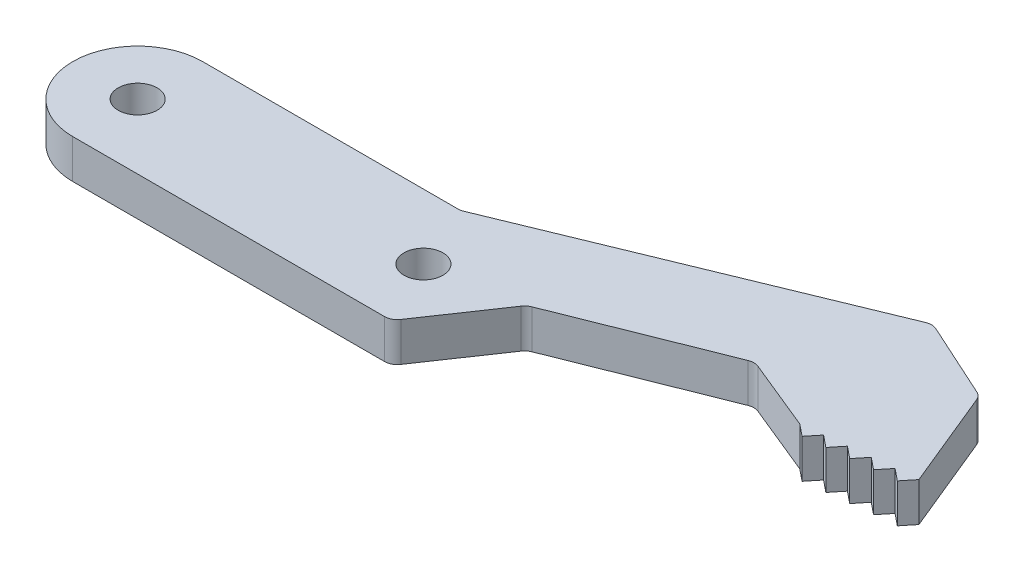
ISO-10303-21;
HEADER;
FILE_DESCRIPTION(('STEP AP214'),'2;1');
FILE_NAME('part.step','',(''),(''),'','','');
FILE_SCHEMA(('AUTOMOTIVE_DESIGN { 1 0 10303 214 1 1 1 1 }'));
ENDSEC;
DATA;
#1=APPLICATION_CONTEXT('core data for automotive mechanical design processes');
#2=APPLICATION_PROTOCOL_DEFINITION('international standard','automotive_design',2000,#1);
#3=PRODUCT_CONTEXT('',#1,'mechanical');
#4=PRODUCT('Part','Part','',(#3));
#5=PRODUCT_RELATED_PRODUCT_CATEGORY('part','',(#4));
#6=PRODUCT_DEFINITION_FORMATION('','',#4);
#7=PRODUCT_DEFINITION_CONTEXT('part definition',#1,'design');
#8=PRODUCT_DEFINITION('design','',#6,#7);
#9=PRODUCT_DEFINITION_SHAPE('','',#8);
#10=(LENGTH_UNIT() NAMED_UNIT(*) SI_UNIT(.MILLI.,.METRE.));
#11=(NAMED_UNIT(*) PLANE_ANGLE_UNIT() SI_UNIT($,.RADIAN.));
#12=(NAMED_UNIT(*) SI_UNIT($,.STERADIAN.) SOLID_ANGLE_UNIT());
#13=UNCERTAINTY_MEASURE_WITH_UNIT(LENGTH_MEASURE(1.E-05),#10,'distance_accuracy_value','');
#14=(GEOMETRIC_REPRESENTATION_CONTEXT(3) GLOBAL_UNCERTAINTY_ASSIGNED_CONTEXT((#13)) GLOBAL_UNIT_ASSIGNED_CONTEXT((#10,
#11,#12)) REPRESENTATION_CONTEXT('',''));
#15=CARTESIAN_POINT('',(0.,0.,0.));
#16=DIRECTION('',(0.,0.,1.));
#17=DIRECTION('',(1.,0.,0.));
#18=AXIS2_PLACEMENT_3D('',#15,#16,#17);
#19=CARTESIAN_POINT('',(29.3927079970185,3.,-0.393076672311641));
#20=DIRECTION('',(0.,-1.,0.));
#21=DIRECTION('',(0.,0.,-1.));
#22=AXIS2_PLACEMENT_3D('',#19,#20,#21);
#23=PLANE('',#22);
#24=CARTESIAN_POINT('',(29.3927079970185,3.,-0.393076672311641));
#25=DIRECTION('',(0.,-1.,0.));
#26=DIRECTION('',(0.,0.,-1.));
#27=AXIS2_PLACEMENT_3D('',#24,#25,#26);
#28=CIRCLE('',#27,1.);
#29=CARTESIAN_POINT('',(28.5649413257824,3.,-0.954149161381216));
#30=VERTEX_POINT('',#29);
#31=CARTESIAN_POINT('',(29.022312673,3.,-1.32195088551018));
#32=VERTEX_POINT('',#31);
#33=EDGE_CURVE('E327',#30,#32,#28,.T.);
#34=ORIENTED_EDGE('',*,*,#33,.T.);
#35=DIRECTION('',(0.92887421319854,0.,-0.370395324018532));
#36=VECTOR('',#35,1.);
#37=CARTESIAN_POINT('',(29.022312673,3.,-1.32195088551018));
#38=LINE('',#37,#36);
#39=CARTESIAN_POINT('',(40.9295532164884,3.,-6.07004934341117));
#40=VERTEX_POINT('',#39);
#41=EDGE_CURVE('E161',#32,#40,#38,.T.);
#42=ORIENTED_EDGE('',*,*,#41,.T.);
#43=CARTESIAN_POINT('',(41.2999485405069,3.,-5.14117513021263));
#44=DIRECTION('',(0.,-1.,0.));
#45=DIRECTION('',(0.,0.,-1.));
#46=AXIS2_PLACEMENT_3D('',#43,#44,#45);
#47=CIRCLE('',#46,1.);
#48=CARTESIAN_POINT('',(41.6787586893829,3.,-6.06664953348294));
#49=VERTEX_POINT('',#48);
#50=EDGE_CURVE('E416',#40,#49,#47,.T.);
#51=ORIENTED_EDGE('',*,*,#50,.T.);
#52=DIRECTION('',(0.925474403270305,0.,0.378810148876022));
#53=VECTOR('',#52,1.);
#54=CARTESIAN_POINT('',(41.6787586893829,3.,-6.06664953348294));
#55=LINE('',#54,#53);
#56=CARTESIAN_POINT('',(47.1445862437582,3.,-3.82940672883367));
#57=VERTEX_POINT('',#56);
#58=EDGE_CURVE('E436',#49,#57,#55,.T.);
#59=ORIENTED_EDGE('',*,*,#58,.T.);
#60=DIRECTION('',(0.777249081254573,0.,0.629193027368329));
#61=VECTOR('',#60,1.);
#62=CARTESIAN_POINT('',(47.1445862437582,3.,-3.82940672883367));
#63=LINE('',#62,#61);
#64=CARTESIAN_POINT('',(48.0617401596386,3.,-3.08695895653906));
#65=VERTEX_POINT('',#64);
#66=EDGE_CURVE('E432',#57,#65,#63,.T.);
#67=ORIENTED_EDGE('',*,*,#66,.T.);
#68=DIRECTION('',(0.629193027368274,0.,-0.777249081254617));
#69=VECTOR('',#68,1.);
#70=CARTESIAN_POINT('',(48.0617401596386,3.,-3.08695895653906));
#71=LINE('',#70,#69);
#72=CARTESIAN_POINT('',(48.8041879319331,3.,-4.0041128724195));
#73=VERTEX_POINT('',#72);
#74=EDGE_CURVE('E435',#65,#73,#71,.T.);
#75=ORIENTED_EDGE('',*,*,#74,.T.);
#76=DIRECTION('',(0.777249081254579,0.,0.62919302736832));
#77=VECTOR('',#76,1.);
#78=CARTESIAN_POINT('',(48.8041879319331,3.,-4.0041128724195));
#79=LINE('',#78,#77);
#80=CARTESIAN_POINT('',(49.7213418478136,3.,-3.26166510012488));
#81=VERTEX_POINT('',#80);
#82=EDGE_CURVE('E440',#73,#81,#79,.T.);
#83=ORIENTED_EDGE('',*,*,#82,.T.);
#84=DIRECTION('',(0.629193027368325,0.,-0.777249081254575));
#85=VECTOR('',#84,1.);
#86=CARTESIAN_POINT('',(49.7213418478136,3.,-3.26166510012488));
#87=LINE('',#86,#85);
#88=CARTESIAN_POINT('',(50.4637896201082,3.,-4.17881901600528));
#89=VERTEX_POINT('',#88);
#90=EDGE_CURVE('E447',#81,#89,#87,.T.);
#91=ORIENTED_EDGE('',*,*,#90,.T.);
#92=DIRECTION('',(0.777249081254577,0.,0.629193027368323));
#93=VECTOR('',#92,1.);
#94=CARTESIAN_POINT('',(50.4637896201082,3.,-4.17881901600528));
#95=LINE('',#94,#93);
#96=CARTESIAN_POINT('',(51.3809435359886,3.,-3.43637124371065));
#97=VERTEX_POINT('',#96);
#98=EDGE_CURVE('E450',#89,#97,#95,.T.);
#99=ORIENTED_EDGE('',*,*,#98,.T.);
#100=DIRECTION('',(0.629193027368326,0.,-0.777249081254575));
#101=VECTOR('',#100,1.);
#102=CARTESIAN_POINT('',(51.3809435359886,3.,-3.43637124371065));
#103=LINE('',#102,#101);
#104=CARTESIAN_POINT('',(52.1233913082832,3.,-4.35352515959105));
#105=VERTEX_POINT('',#104);
#106=EDGE_CURVE('E453',#97,#105,#103,.T.);
#107=ORIENTED_EDGE('',*,*,#106,.T.);
#108=DIRECTION('',(0.777249081254583,0.,0.629193027368317));
#109=VECTOR('',#108,1.);
#110=CARTESIAN_POINT('',(52.1233913082832,3.,-4.35352515959105));
#111=LINE('',#110,#109);
#112=CARTESIAN_POINT('',(53.0405452241636,3.,-3.61107738729644));
#113=VERTEX_POINT('',#112);
#114=EDGE_CURVE('E456',#105,#113,#111,.T.);
#115=ORIENTED_EDGE('',*,*,#114,.T.);
#116=DIRECTION('',(0.629193027368326,0.,-0.777249081254575));
#117=VECTOR('',#116,1.);
#118=CARTESIAN_POINT('',(53.0405452241636,3.,-3.61107738729644));
#119=LINE('',#118,#117);
#120=CARTESIAN_POINT('',(53.7829929964582,3.,-4.52823130317683));
#121=VERTEX_POINT('',#120);
#122=EDGE_CURVE('E459',#113,#121,#119,.T.);
#123=ORIENTED_EDGE('',*,*,#122,.T.);
#124=DIRECTION('',(0.777249081254587,0.,0.629193027368311));
#125=VECTOR('',#124,1.);
#126=CARTESIAN_POINT('',(53.7829929964582,3.,-4.52823130317683));
#127=LINE('',#126,#125);
#128=CARTESIAN_POINT('',(54.7001469123387,3.,-3.78578353088222));
#129=VERTEX_POINT('',#128);
#130=EDGE_CURVE('E462',#121,#129,#127,.T.);
#131=ORIENTED_EDGE('',*,*,#130,.T.);
#132=DIRECTION('',(0.629193027368273,0.,-0.777249081254618));
#133=VECTOR('',#132,1.);
#134=CARTESIAN_POINT('',(54.7001469123387,3.,-3.78578353088222));
#135=LINE('',#134,#133);
#136=CARTESIAN_POINT('',(55.4425946846332,3.,-4.70293744676266));
#137=VERTEX_POINT('',#136);
#138=EDGE_CURVE('E465',#129,#137,#135,.T.);
#139=ORIENTED_EDGE('',*,*,#138,.T.);
#140=DIRECTION('',(-0.380263412733204,0.,-0.92487822816655));
#141=VECTOR('',#140,1.);
#142=CARTESIAN_POINT('',(52.341745918113,3.,-12.2448345027485));
#143=LINE('',#142,#141);
#144=CARTESIAN_POINT('',(52.341745918113,3.,-12.2448345027485));
#145=VERTEX_POINT('',#144);
#146=EDGE_CURVE('E468',#137,#145,#143,.T.);
#147=ORIENTED_EDGE('',*,*,#146,.T.);
#148=CARTESIAN_POINT('',(51.4168676899464,3.,-11.8645710900153));
#149=DIRECTION('',(0.,1.,0.));
#150=DIRECTION('',(0.,0.,-1.));
#151=AXIS2_PLACEMENT_3D('',#148,#149,#150);
#152=CIRCLE('',#151,1.);
#153=CARTESIAN_POINT('',(51.8314021080849,3.,-12.7746047246566));
#154=VERTEX_POINT('',#153);
#155=EDGE_CURVE('E471',#145,#154,#152,.T.);
#156=ORIENTED_EDGE('',*,*,#155,.T.);
#157=DIRECTION('',(-0.910033634641374,0.,-0.414534418138482));
#158=VECTOR('',#157,1.);
#159=CARTESIAN_POINT('',(46.0241839243038,3.,-15.4198825684427));
#160=LINE('',#159,#158);
#161=CARTESIAN_POINT('',(46.0241839243038,3.,-15.4198825684427));
#162=VERTEX_POINT('',#161);
#163=EDGE_CURVE('E474',#154,#162,#160,.T.);
#164=ORIENTED_EDGE('',*,*,#163,.T.);
#165=CARTESIAN_POINT('',(45.6096495061653,3.,-14.5098489338013));
#166=DIRECTION('',(0.,1.,0.));
#167=DIRECTION('',(0.,0.,-1.));
#168=AXIS2_PLACEMENT_3D('',#165,#166,#167);
#169=CIRCLE('',#168,1.);
#170=CARTESIAN_POINT('',(45.2293860934321,3.,-15.4347271619678));
#171=VERTEX_POINT('',#170);
#172=EDGE_CURVE('E477',#162,#171,#169,.T.);
#173=ORIENTED_EDGE('',*,*,#172,.T.);
#174=DIRECTION('',(-0.924878228166549,0.,0.380263412733207));
#175=VECTOR('',#174,1.);
#176=CARTESIAN_POINT('',(20.0327114807882,3.,-5.07512177183345));
#177=LINE('',#176,#175);
#178=CARTESIAN_POINT('',(20.0327114807882,3.,-5.07512177183345));
#179=VERTEX_POINT('',#178);
#180=EDGE_CURVE('E480',#171,#179,#177,.T.);
#181=ORIENTED_EDGE('',*,*,#180,.T.);
#182=CARTESIAN_POINT('',(19.652448068055,3.,-6.));
#183=DIRECTION('',(0.,-1.,0.));
#184=DIRECTION('',(0.,0.,1.));
#185=AXIS2_PLACEMENT_3D('',#182,#183,#184);
#186=CIRCLE('',#185,1.);
#187=CARTESIAN_POINT('',(19.652448068055,3.,-5.));
#188=VERTEX_POINT('',#187);
#189=EDGE_CURVE('E483',#179,#188,#186,.T.);
#190=ORIENTED_EDGE('',*,*,#189,.T.);
#191=DIRECTION('',(-1.,0.,0.));
#192=VECTOR('',#191,1.);
#193=CARTESIAN_POINT('',(0.,3.,-5.));
#194=LINE('',#193,#192);
#195=CARTESIAN_POINT('',(0.,3.,-5.));
#196=VERTEX_POINT('',#195);
#197=EDGE_CURVE('E486',#188,#196,#194,.T.);
#198=ORIENTED_EDGE('',*,*,#197,.T.);
#199=CARTESIAN_POINT('',(0.,3.,0.));
#200=DIRECTION('',(0.,1.,0.));
#201=DIRECTION('',(0.,0.,1.));
#202=AXIS2_PLACEMENT_3D('',#199,#200,#201);
#203=CIRCLE('',#202,5.);
#204=CARTESIAN_POINT('',(0.,3.,5.));
#205=VERTEX_POINT('',#204);
#206=EDGE_CURVE('E231',#196,#205,#203,.T.);
#207=ORIENTED_EDGE('',*,*,#206,.T.);
#208=DIRECTION('',(1.,0.,0.));
#209=VECTOR('',#208,1.);
#210=CARTESIAN_POINT('',(0.,3.,5.));
#211=LINE('',#210,#209);
#212=CARTESIAN_POINT('',(23.9988758721515,3.,5.));
#213=VERTEX_POINT('',#212);
#214=EDGE_CURVE('E225',#205,#213,#211,.T.);
#215=ORIENTED_EDGE('',*,*,#214,.T.);
#216=CARTESIAN_POINT('',(23.9988758721515,3.,4.));
#217=DIRECTION('',(0.,1.,0.));
#218=DIRECTION('',(0.,0.,1.));
#219=AXIS2_PLACEMENT_3D('',#216,#217,#218);
#220=CIRCLE('',#219,1.);
#221=CARTESIAN_POINT('',(24.8266425433876,3.,4.56107248906957));
#222=VERTEX_POINT('',#221);
#223=EDGE_CURVE('E229',#213,#222,#220,.T.);
#224=ORIENTED_EDGE('',*,*,#223,.T.);
#225=DIRECTION('',(0.561072489069578,0.,-0.827766671236085));
#226=VECTOR('',#225,1.);
#227=CARTESIAN_POINT('',(24.8266425433876,3.,4.56107248906957));
#228=LINE('',#227,#226);
#229=EDGE_CURVE('E67',#222,#30,#228,.T.);
#230=ORIENTED_EDGE('',*,*,#229,.T.);
#231=EDGE_LOOP('',(#34,#42,#51,#59,#67,#75,#83,#91,#99,#107,#115,#123,#131,#139,#147,#156,#164,
#173,#181,#190,#198,#207,#215,#224,#230));
#232=FACE_BOUND('',#231,.T.);
#233=CARTESIAN_POINT('',(0.,3.,0.));
#234=DIRECTION('',(0.,1.,0.));
#235=DIRECTION('',(0.,0.,1.));
#236=AXIS2_PLACEMENT_3D('',#233,#234,#235);
#237=CIRCLE('',#236,1.5);
#238=CARTESIAN_POINT('',(0.,3.,1.5));
#239=VERTEX_POINT('',#238);
#240=EDGE_CURVE('E258',#239,#239,#237,.T.);
#241=ORIENTED_EDGE('',*,*,#240,.F.);
#242=EDGE_LOOP('',(#241));
#243=FACE_BOUND('',#242,.T.);
#244=CARTESIAN_POINT('',(22.,3.,0.));
#245=DIRECTION('',(0.,1.,0.));
#246=DIRECTION('',(0.,0.,1.));
#247=AXIS2_PLACEMENT_3D('',#244,#245,#246);
#248=CIRCLE('',#247,1.5);
#249=CARTESIAN_POINT('',(22.,3.,1.5));
#250=VERTEX_POINT('',#249);
#251=EDGE_CURVE('E529',#250,#250,#248,.T.);
#252=ORIENTED_EDGE('',*,*,#251,.F.);
#253=EDGE_LOOP('',(#252));
#254=FACE_BOUND('',#253,.T.);
#255=ADVANCED_FACE('F49',(#232,#243,#254),#23,.F.);
#256=CARTESIAN_POINT('',(29.3927079970185,0.,-0.393076672311641));
#257=DIRECTION('',(0.,-1.,0.));
#258=DIRECTION('',(0.,0.,-1.));
#259=AXIS2_PLACEMENT_3D('',#256,#257,#258);
#260=PLANE('',#259);
#261=CARTESIAN_POINT('',(0.,0.,0.));
#262=DIRECTION('',(0.,1.,0.));
#263=DIRECTION('',(0.,0.,1.));
#264=AXIS2_PLACEMENT_3D('',#261,#262,#263);
#265=CIRCLE('',#264,1.5);
#266=CARTESIAN_POINT('',(0.,0.,1.5));
#267=VERTEX_POINT('',#266);
#268=EDGE_CURVE('E536',#267,#267,#265,.T.);
#269=ORIENTED_EDGE('',*,*,#268,.T.);
#270=EDGE_LOOP('',(#269));
#271=FACE_BOUND('',#270,.T.);
#272=CARTESIAN_POINT('',(29.3927079970185,0.,-0.393076672311641));
#273=DIRECTION('',(0.,-1.,0.));
#274=DIRECTION('',(0.,0.,-1.));
#275=AXIS2_PLACEMENT_3D('',#272,#273,#274);
#276=CIRCLE('',#275,1.);
#277=CARTESIAN_POINT('',(28.5649413257824,0.,-0.954149161381216));
#278=VERTEX_POINT('',#277);
#279=CARTESIAN_POINT('',(29.022312673,0.,-1.32195088551018));
#280=VERTEX_POINT('',#279);
#281=EDGE_CURVE('E253',#278,#280,#276,.T.);
#282=ORIENTED_EDGE('',*,*,#281,.F.);
#283=DIRECTION('',(0.561072489069578,0.,-0.827766671236085));
#284=VECTOR('',#283,1.);
#285=CARTESIAN_POINT('',(24.8266425433876,0.,4.56107248906957));
#286=LINE('',#285,#284);
#287=CARTESIAN_POINT('',(24.8266425433876,0.,4.56107248906957));
#288=VERTEX_POINT('',#287);
#289=EDGE_CURVE('E153',#288,#278,#286,.T.);
#290=ORIENTED_EDGE('',*,*,#289,.F.);
#291=CARTESIAN_POINT('',(23.9988758721515,0.,4.));
#292=DIRECTION('',(0.,1.,0.));
#293=DIRECTION('',(0.,0.,1.));
#294=AXIS2_PLACEMENT_3D('',#291,#292,#293);
#295=CIRCLE('',#294,1.);
#296=CARTESIAN_POINT('',(23.9988758721515,0.,5.));
#297=VERTEX_POINT('',#296);
#298=EDGE_CURVE('E147',#297,#288,#295,.T.);
#299=ORIENTED_EDGE('',*,*,#298,.F.);
#300=DIRECTION('',(1.,0.,0.));
#301=VECTOR('',#300,1.);
#302=CARTESIAN_POINT('',(0.,0.,5.));
#303=LINE('',#302,#301);
#304=CARTESIAN_POINT('',(0.,0.,5.));
#305=VERTEX_POINT('',#304);
#306=EDGE_CURVE('E240',#305,#297,#303,.T.);
#307=ORIENTED_EDGE('',*,*,#306,.F.);
#308=CARTESIAN_POINT('',(0.,0.,0.));
#309=DIRECTION('',(0.,1.,0.));
#310=DIRECTION('',(0.,0.,1.));
#311=AXIS2_PLACEMENT_3D('',#308,#309,#310);
#312=CIRCLE('',#311,5.);
#313=CARTESIAN_POINT('',(0.,0.,-5.));
#314=VERTEX_POINT('',#313);
#315=EDGE_CURVE('E318',#314,#305,#312,.T.);
#316=ORIENTED_EDGE('',*,*,#315,.F.);
#317=DIRECTION('',(-1.,0.,0.));
#318=VECTOR('',#317,1.);
#319=CARTESIAN_POINT('',(0.,0.,-5.));
#320=LINE('',#319,#318);
#321=CARTESIAN_POINT('',(19.652448068055,0.,-5.));
#322=VERTEX_POINT('',#321);
#323=EDGE_CURVE('E315',#322,#314,#320,.T.);
#324=ORIENTED_EDGE('',*,*,#323,.F.);
#325=CARTESIAN_POINT('',(19.652448068055,0.,-6.));
#326=DIRECTION('',(0.,-1.,0.));
#327=DIRECTION('',(0.,0.,1.));
#328=AXIS2_PLACEMENT_3D('',#325,#326,#327);
#329=CIRCLE('',#328,1.);
#330=CARTESIAN_POINT('',(20.0327114807882,0.,-5.07512177183345));
#331=VERTEX_POINT('',#330);
#332=EDGE_CURVE('E312',#331,#322,#329,.T.);
#333=ORIENTED_EDGE('',*,*,#332,.F.);
#334=DIRECTION('',(-0.924878228166549,0.,0.380263412733207));
#335=VECTOR('',#334,1.);
#336=CARTESIAN_POINT('',(20.0327114807882,0.,-5.07512177183345));
#337=LINE('',#336,#335);
#338=CARTESIAN_POINT('',(45.2293860934321,0.,-15.4347271619678));
#339=VERTEX_POINT('',#338);
#340=EDGE_CURVE('E309',#339,#331,#337,.T.);
#341=ORIENTED_EDGE('',*,*,#340,.F.);
#342=CARTESIAN_POINT('',(45.6096495061653,0.,-14.5098489338013));
#343=DIRECTION('',(0.,1.,0.));
#344=DIRECTION('',(0.,0.,-1.));
#345=AXIS2_PLACEMENT_3D('',#342,#343,#344);
#346=CIRCLE('',#345,1.);
#347=CARTESIAN_POINT('',(46.0241839243038,0.,-15.4198825684427));
#348=VERTEX_POINT('',#347);
#349=EDGE_CURVE('E306',#348,#339,#346,.T.);
#350=ORIENTED_EDGE('',*,*,#349,.F.);
#351=DIRECTION('',(-0.910033634641374,0.,-0.414534418138482));
#352=VECTOR('',#351,1.);
#353=CARTESIAN_POINT('',(46.0241839243038,0.,-15.4198825684427));
#354=LINE('',#353,#352);
#355=CARTESIAN_POINT('',(51.8314021080849,0.,-12.7746047246566));
#356=VERTEX_POINT('',#355);
#357=EDGE_CURVE('E303',#356,#348,#354,.T.);
#358=ORIENTED_EDGE('',*,*,#357,.F.);
#359=CARTESIAN_POINT('',(51.4168676899464,0.,-11.8645710900153));
#360=DIRECTION('',(0.,1.,0.));
#361=DIRECTION('',(0.,0.,-1.));
#362=AXIS2_PLACEMENT_3D('',#359,#360,#361);
#363=CIRCLE('',#362,1.);
#364=CARTESIAN_POINT('',(52.341745918113,0.,-12.2448345027485));
#365=VERTEX_POINT('',#364);
#366=EDGE_CURVE('E300',#365,#356,#363,.T.);
#367=ORIENTED_EDGE('',*,*,#366,.F.);
#368=DIRECTION('',(-0.380263412733204,0.,-0.92487822816655));
#369=VECTOR('',#368,1.);
#370=CARTESIAN_POINT('',(52.341745918113,0.,-12.2448345027485));
#371=LINE('',#370,#369);
#372=CARTESIAN_POINT('',(55.4425946846332,0.,-4.70293744676266));
#373=VERTEX_POINT('',#372);
#374=EDGE_CURVE('E297',#373,#365,#371,.T.);
#375=ORIENTED_EDGE('',*,*,#374,.F.);
#376=DIRECTION('',(0.629193027368273,0.,-0.777249081254618));
#377=VECTOR('',#376,1.);
#378=CARTESIAN_POINT('',(54.7001469123387,0.,-3.78578353088222));
#379=LINE('',#378,#377);
#380=CARTESIAN_POINT('',(54.7001469123387,0.,-3.78578353088222));
#381=VERTEX_POINT('',#380);
#382=EDGE_CURVE('E294',#381,#373,#379,.T.);
#383=ORIENTED_EDGE('',*,*,#382,.F.);
#384=DIRECTION('',(0.777249081254587,0.,0.629193027368311));
#385=VECTOR('',#384,1.);
#386=CARTESIAN_POINT('',(53.7829929964582,0.,-4.52823130317683));
#387=LINE('',#386,#385);
#388=CARTESIAN_POINT('',(53.7829929964582,0.,-4.52823130317683));
#389=VERTEX_POINT('',#388);
#390=EDGE_CURVE('E291',#389,#381,#387,.T.);
#391=ORIENTED_EDGE('',*,*,#390,.F.);
#392=DIRECTION('',(0.629193027368326,0.,-0.777249081254575));
#393=VECTOR('',#392,1.);
#394=CARTESIAN_POINT('',(53.0405452241636,0.,-3.61107738729644));
#395=LINE('',#394,#393);
#396=CARTESIAN_POINT('',(53.0405452241636,0.,-3.61107738729644));
#397=VERTEX_POINT('',#396);
#398=EDGE_CURVE('E288',#397,#389,#395,.T.);
#399=ORIENTED_EDGE('',*,*,#398,.F.);
#400=DIRECTION('',(0.777249081254583,0.,0.629193027368317));
#401=VECTOR('',#400,1.);
#402=CARTESIAN_POINT('',(52.1233913082832,0.,-4.35352515959105));
#403=LINE('',#402,#401);
#404=CARTESIAN_POINT('',(52.1233913082832,0.,-4.35352515959105));
#405=VERTEX_POINT('',#404);
#406=EDGE_CURVE('E285',#405,#397,#403,.T.);
#407=ORIENTED_EDGE('',*,*,#406,.F.);
#408=DIRECTION('',(0.629193027368326,0.,-0.777249081254575));
#409=VECTOR('',#408,1.);
#410=CARTESIAN_POINT('',(51.3809435359886,0.,-3.43637124371065));
#411=LINE('',#410,#409);
#412=CARTESIAN_POINT('',(51.3809435359886,0.,-3.43637124371065));
#413=VERTEX_POINT('',#412);
#414=EDGE_CURVE('E282',#413,#405,#411,.T.);
#415=ORIENTED_EDGE('',*,*,#414,.F.);
#416=DIRECTION('',(0.777249081254577,0.,0.629193027368323));
#417=VECTOR('',#416,1.);
#418=CARTESIAN_POINT('',(50.4637896201082,0.,-4.17881901600528));
#419=LINE('',#418,#417);
#420=CARTESIAN_POINT('',(50.4637896201082,0.,-4.17881901600528));
#421=VERTEX_POINT('',#420);
#422=EDGE_CURVE('E279',#421,#413,#419,.T.);
#423=ORIENTED_EDGE('',*,*,#422,.F.);
#424=DIRECTION('',(0.629193027368325,0.,-0.777249081254575));
#425=VECTOR('',#424,1.);
#426=CARTESIAN_POINT('',(49.7213418478136,0.,-3.26166510012488));
#427=LINE('',#426,#425);
#428=CARTESIAN_POINT('',(49.7213418478136,0.,-3.26166510012488));
#429=VERTEX_POINT('',#428);
#430=EDGE_CURVE('E276',#429,#421,#427,.T.);
#431=ORIENTED_EDGE('',*,*,#430,.F.);
#432=DIRECTION('',(0.777249081254579,0.,0.62919302736832));
#433=VECTOR('',#432,1.);
#434=CARTESIAN_POINT('',(48.8041879319331,0.,-4.0041128724195));
#435=LINE('',#434,#433);
#436=CARTESIAN_POINT('',(48.8041879319331,0.,-4.0041128724195));
#437=VERTEX_POINT('',#436);
#438=EDGE_CURVE('E273',#437,#429,#435,.T.);
#439=ORIENTED_EDGE('',*,*,#438,.F.);
#440=DIRECTION('',(0.629193027368274,0.,-0.777249081254617));
#441=VECTOR('',#440,1.);
#442=CARTESIAN_POINT('',(48.0617401596386,0.,-3.08695895653906));
#443=LINE('',#442,#441);
#444=CARTESIAN_POINT('',(48.0617401596386,0.,-3.08695895653906));
#445=VERTEX_POINT('',#444);
#446=EDGE_CURVE('E270',#445,#437,#443,.T.);
#447=ORIENTED_EDGE('',*,*,#446,.F.);
#448=DIRECTION('',(0.777249081254573,0.,0.629193027368329));
#449=VECTOR('',#448,1.);
#450=CARTESIAN_POINT('',(47.1445862437582,0.,-3.82940672883367));
#451=LINE('',#450,#449);
#452=CARTESIAN_POINT('',(47.1445862437582,0.,-3.82940672883367));
#453=VERTEX_POINT('',#452);
#454=EDGE_CURVE('E267',#453,#445,#451,.T.);
#455=ORIENTED_EDGE('',*,*,#454,.F.);
#456=DIRECTION('',(0.925474403270305,0.,0.378810148876022));
#457=VECTOR('',#456,1.);
#458=CARTESIAN_POINT('',(41.6787586893829,0.,-6.06664953348294));
#459=LINE('',#458,#457);
#460=CARTESIAN_POINT('',(41.6787586893829,0.,-6.06664953348294));
#461=VERTEX_POINT('',#460);
#462=EDGE_CURVE('E264',#461,#453,#459,.T.);
#463=ORIENTED_EDGE('',*,*,#462,.F.);
#464=CARTESIAN_POINT('',(41.2999485405069,0.,-5.14117513021263));
#465=DIRECTION('',(0.,-1.,0.));
#466=DIRECTION('',(0.,0.,-1.));
#467=AXIS2_PLACEMENT_3D('',#464,#465,#466);
#468=CIRCLE('',#467,1.);
#469=CARTESIAN_POINT('',(40.9295532164884,0.,-6.07004934341117));
#470=VERTEX_POINT('',#469);
#471=EDGE_CURVE('E261',#470,#461,#468,.T.);
#472=ORIENTED_EDGE('',*,*,#471,.F.);
#473=DIRECTION('',(0.92887421319854,0.,-0.370395324018532));
#474=VECTOR('',#473,1.);
#475=CARTESIAN_POINT('',(29.022312673,0.,-1.32195088551018));
#476=LINE('',#475,#474);
#477=EDGE_CURVE('E257',#280,#470,#476,.T.);
#478=ORIENTED_EDGE('',*,*,#477,.F.);
#479=EDGE_LOOP('',(#282,#290,#299,#307,#316,#324,#333,#341,#350,#358,#367,#375,#383,#391,#399,
#407,#415,#423,#431,#439,#447,#455,#463,#472,#478));
#480=FACE_BOUND('',#479,.T.);
#481=CARTESIAN_POINT('',(22.,0.,0.));
#482=DIRECTION('',(0.,1.,0.));
#483=DIRECTION('',(0.,0.,1.));
#484=AXIS2_PLACEMENT_3D('',#481,#482,#483);
#485=CIRCLE('',#484,1.5);
#486=CARTESIAN_POINT('',(22.,0.,1.5));
#487=VERTEX_POINT('',#486);
#488=EDGE_CURVE('E532',#487,#487,#485,.T.);
#489=ORIENTED_EDGE('',*,*,#488,.T.);
#490=EDGE_LOOP('',(#489));
#491=FACE_BOUND('',#490,.T.);
#492=ADVANCED_FACE('F420',(#271,#480,#491),#260,.T.);
#493=CARTESIAN_POINT('',(29.3927079970185,3.,-0.393076672311641));
#494=DIRECTION('',(0.,-1.,0.));
#495=DIRECTION('',(0.,0.,-1.));
#496=AXIS2_PLACEMENT_3D('',#493,#494,#495);
#497=CYLINDRICAL_SURFACE('',#496,1.);
#498=ORIENTED_EDGE('',*,*,#281,.T.);
#499=DIRECTION('',(0.,-1.,0.));
#500=VECTOR('',#499,1.);
#501=CARTESIAN_POINT('',(29.022312673,3.,-1.32195088551018));
#502=LINE('',#501,#500);
#503=EDGE_CURVE('E13',#32,#280,#502,.T.);
#504=ORIENTED_EDGE('',*,*,#503,.F.);
#505=ORIENTED_EDGE('',*,*,#33,.F.);
#506=DIRECTION('',(0.,-1.,0.));
#507=VECTOR('',#506,1.);
#508=CARTESIAN_POINT('',(28.5649413257824,3.,-0.954149161381216));
#509=LINE('',#508,#507);
#510=EDGE_CURVE('E249',#30,#278,#509,.T.);
#511=ORIENTED_EDGE('',*,*,#510,.T.);
#512=EDGE_LOOP('',(#498,#504,#505,#511));
#513=FACE_BOUND('',#512,.T.);
#514=ADVANCED_FACE('F51',(#513),#497,.F.);
#515=CARTESIAN_POINT('',(29.022312673,3.,-1.32195088551018));
#516=DIRECTION('',(-0.370395324018532,0.,-0.92887421319854));
#517=DIRECTION('',(-0.92887421319854,0.,0.370395324018532));
#518=AXIS2_PLACEMENT_3D('',#515,#516,#517);
#519=PLANE('',#518);
#520=ORIENTED_EDGE('',*,*,#477,.T.);
#521=DIRECTION('',(0.,-1.,0.));
#522=VECTOR('',#521,1.);
#523=CARTESIAN_POINT('',(40.9295532164884,3.,-6.07004934341117));
#524=LINE('',#523,#522);
#525=EDGE_CURVE('E59',#40,#470,#524,.T.);
#526=ORIENTED_EDGE('',*,*,#525,.F.);
#527=ORIENTED_EDGE('',*,*,#41,.F.);
#528=ORIENTED_EDGE('',*,*,#503,.T.);
#529=EDGE_LOOP('',(#520,#526,#527,#528));
#530=FACE_BOUND('',#529,.T.);
#531=ADVANCED_FACE('F766',(#530),#519,.F.);
#532=CARTESIAN_POINT('',(41.2999485405069,3.,-5.14117513021263));
#533=DIRECTION('',(0.,-1.,0.));
#534=DIRECTION('',(0.,0.,-1.));
#535=AXIS2_PLACEMENT_3D('',#532,#533,#534);
#536=CYLINDRICAL_SURFACE('',#535,1.);
#537=ORIENTED_EDGE('',*,*,#471,.T.);
#538=DIRECTION('',(0.,-1.,0.));
#539=VECTOR('',#538,1.);
#540=CARTESIAN_POINT('',(41.6787586893829,3.,-6.06664953348294));
#541=LINE('',#540,#539);
#542=EDGE_CURVE('E406',#49,#461,#541,.T.);
#543=ORIENTED_EDGE('',*,*,#542,.F.);
#544=ORIENTED_EDGE('',*,*,#50,.F.);
#545=ORIENTED_EDGE('',*,*,#525,.T.);
#546=EDGE_LOOP('',(#537,#543,#544,#545));
#547=FACE_BOUND('',#546,.T.);
#548=ADVANCED_FACE('F414',(#547),#536,.F.);
#549=CARTESIAN_POINT('',(41.6787586893829,3.,-6.06664953348294));
#550=DIRECTION('',(0.378810148876022,0.,-0.925474403270305));
#551=DIRECTION('',(-0.925474403270305,0.,-0.378810148876022));
#552=AXIS2_PLACEMENT_3D('',#549,#550,#551);
#553=PLANE('',#552);
#554=ORIENTED_EDGE('',*,*,#462,.T.);
#555=DIRECTION('',(0.,-1.,0.));
#556=VECTOR('',#555,1.);
#557=CARTESIAN_POINT('',(47.1445862437582,3.,-3.82940672883367));
#558=LINE('',#557,#556);
#559=EDGE_CURVE('E402',#57,#453,#558,.T.);
#560=ORIENTED_EDGE('',*,*,#559,.F.);
#561=ORIENTED_EDGE('',*,*,#58,.F.);
#562=ORIENTED_EDGE('',*,*,#542,.T.);
#563=EDGE_LOOP('',(#554,#560,#561,#562));
#564=FACE_BOUND('',#563,.T.);
#565=ADVANCED_FACE('F426',(#564),#553,.F.);
#566=CARTESIAN_POINT('',(47.1445862437582,3.,-3.82940672883367));
#567=DIRECTION('',(0.629193027368329,0.,-0.777249081254573));
#568=DIRECTION('',(-0.777249081254573,0.,-0.629193027368329));
#569=AXIS2_PLACEMENT_3D('',#566,#567,#568);
#570=PLANE('',#569);
#571=ORIENTED_EDGE('',*,*,#454,.T.);
#572=DIRECTION('',(0.,-1.,0.));
#573=VECTOR('',#572,1.);
#574=CARTESIAN_POINT('',(48.0617401596386,3.,-3.08695895653906));
#575=LINE('',#574,#573);
#576=EDGE_CURVE('E398',#65,#445,#575,.T.);
#577=ORIENTED_EDGE('',*,*,#576,.F.);
#578=ORIENTED_EDGE('',*,*,#66,.F.);
#579=ORIENTED_EDGE('',*,*,#559,.T.);
#580=EDGE_LOOP('',(#571,#577,#578,#579));
#581=FACE_BOUND('',#580,.T.);
#582=ADVANCED_FACE('F430',(#581),#570,.F.);
#583=CARTESIAN_POINT('',(48.0617401596386,3.,-3.08695895653906));
#584=DIRECTION('',(-0.777249081254617,0.,-0.629193027368274));
#585=DIRECTION('',(-0.629193027368274,0.,0.777249081254617));
#586=AXIS2_PLACEMENT_3D('',#583,#584,#585);
#587=PLANE('',#586);
#588=ORIENTED_EDGE('',*,*,#446,.T.);
#589=DIRECTION('',(0.,-1.,0.));
#590=VECTOR('',#589,1.);
#591=CARTESIAN_POINT('',(48.8041879319331,3.,-4.0041128724195));
#592=LINE('',#591,#590);
#593=EDGE_CURVE('E394',#73,#437,#592,.T.);
#594=ORIENTED_EDGE('',*,*,#593,.F.);
#595=ORIENTED_EDGE('',*,*,#74,.F.);
#596=ORIENTED_EDGE('',*,*,#576,.T.);
#597=EDGE_LOOP('',(#588,#594,#595,#596));
#598=FACE_BOUND('',#597,.T.);
#599=ADVANCED_FACE('F731',(#598),#587,.F.);
#600=CARTESIAN_POINT('',(48.8041879319331,3.,-4.0041128724195));
#601=DIRECTION('',(0.62919302736832,0.,-0.77724908125458));
#602=DIRECTION('',(-0.77724908125458,0.,-0.62919302736832));
#603=AXIS2_PLACEMENT_3D('',#600,#601,#602);
#604=PLANE('',#603);
#605=ORIENTED_EDGE('',*,*,#438,.T.);
#606=DIRECTION('',(0.,-1.,0.));
#607=VECTOR('',#606,1.);
#608=CARTESIAN_POINT('',(49.7213418478136,3.,-3.26166510012488));
#609=LINE('',#608,#607);
#610=EDGE_CURVE('E390',#81,#429,#609,.T.);
#611=ORIENTED_EDGE('',*,*,#610,.F.);
#612=ORIENTED_EDGE('',*,*,#82,.F.);
#613=ORIENTED_EDGE('',*,*,#593,.T.);
#614=EDGE_LOOP('',(#605,#611,#612,#613));
#615=FACE_BOUND('',#614,.T.);
#616=ADVANCED_FACE('F721',(#615),#604,.F.);
#617=CARTESIAN_POINT('',(49.7213418478136,3.,-3.26166510012488));
#618=DIRECTION('',(-0.777249081254575,0.,-0.629193027368325));
#619=DIRECTION('',(-0.629193027368325,0.,0.777249081254576));
#620=AXIS2_PLACEMENT_3D('',#617,#618,#619);
#621=PLANE('',#620);
#622=ORIENTED_EDGE('',*,*,#430,.T.);
#623=DIRECTION('',(0.,-1.,0.));
#624=VECTOR('',#623,1.);
#625=CARTESIAN_POINT('',(50.4637896201082,3.,-4.17881901600528));
#626=LINE('',#625,#624);
#627=EDGE_CURVE('E386',#89,#421,#626,.T.);
#628=ORIENTED_EDGE('',*,*,#627,.F.);
#629=ORIENTED_EDGE('',*,*,#90,.F.);
#630=ORIENTED_EDGE('',*,*,#610,.T.);
#631=EDGE_LOOP('',(#622,#628,#629,#630));
#632=FACE_BOUND('',#631,.T.);
#633=ADVANCED_FACE('F711',(#632),#621,.F.);
#634=CARTESIAN_POINT('',(50.4637896201082,3.,-4.17881901600528));
#635=DIRECTION('',(0.629193027368323,0.,-0.777249081254577));
#636=DIRECTION('',(-0.777249081254577,0.,-0.629193027368323));
#637=AXIS2_PLACEMENT_3D('',#634,#635,#636);
#638=PLANE('',#637);
#639=ORIENTED_EDGE('',*,*,#422,.T.);
#640=DIRECTION('',(0.,-1.,0.));
#641=VECTOR('',#640,1.);
#642=CARTESIAN_POINT('',(51.3809435359886,3.,-3.43637124371065));
#643=LINE('',#642,#641);
#644=EDGE_CURVE('E382',#97,#413,#643,.T.);
#645=ORIENTED_EDGE('',*,*,#644,.F.);
#646=ORIENTED_EDGE('',*,*,#98,.F.);
#647=ORIENTED_EDGE('',*,*,#627,.T.);
#648=EDGE_LOOP('',(#639,#645,#646,#647));
#649=FACE_BOUND('',#648,.T.);
#650=ADVANCED_FACE('F701',(#649),#638,.F.);
#651=CARTESIAN_POINT('',(51.3809435359886,3.,-3.43637124371065));
#652=DIRECTION('',(-0.777249081254575,0.,-0.629193027368326));
#653=DIRECTION('',(-0.629193027368326,0.,0.777249081254575));
#654=AXIS2_PLACEMENT_3D('',#651,#652,#653);
#655=PLANE('',#654);
#656=ORIENTED_EDGE('',*,*,#414,.T.);
#657=DIRECTION('',(0.,-1.,0.));
#658=VECTOR('',#657,1.);
#659=CARTESIAN_POINT('',(52.1233913082832,3.,-4.35352515959105));
#660=LINE('',#659,#658);
#661=EDGE_CURVE('E378',#105,#405,#660,.T.);
#662=ORIENTED_EDGE('',*,*,#661,.F.);
#663=ORIENTED_EDGE('',*,*,#106,.F.);
#664=ORIENTED_EDGE('',*,*,#644,.T.);
#665=EDGE_LOOP('',(#656,#662,#663,#664));
#666=FACE_BOUND('',#665,.T.);
#667=ADVANCED_FACE('F691',(#666),#655,.F.);
#668=CARTESIAN_POINT('',(52.1233913082832,3.,-4.35352515959105));
#669=DIRECTION('',(0.629193027368317,0.,-0.777249081254583));
#670=DIRECTION('',(-0.777249081254583,0.,-0.629193027368317));
#671=AXIS2_PLACEMENT_3D('',#668,#669,#670);
#672=PLANE('',#671);
#673=ORIENTED_EDGE('',*,*,#406,.T.);
#674=DIRECTION('',(0.,-1.,0.));
#675=VECTOR('',#674,1.);
#676=CARTESIAN_POINT('',(53.0405452241636,3.,-3.61107738729644));
#677=LINE('',#676,#675);
#678=EDGE_CURVE('E374',#113,#397,#677,.T.);
#679=ORIENTED_EDGE('',*,*,#678,.F.);
#680=ORIENTED_EDGE('',*,*,#114,.F.);
#681=ORIENTED_EDGE('',*,*,#661,.T.);
#682=EDGE_LOOP('',(#673,#679,#680,#681));
#683=FACE_BOUND('',#682,.T.);
#684=ADVANCED_FACE('F681',(#683),#672,.F.);
#685=CARTESIAN_POINT('',(53.0405452241636,3.,-3.61107738729644));
#686=DIRECTION('',(-0.777249081254575,0.,-0.629193027368326));
#687=DIRECTION('',(-0.629193027368326,0.,0.777249081254575));
#688=AXIS2_PLACEMENT_3D('',#685,#686,#687);
#689=PLANE('',#688);
#690=ORIENTED_EDGE('',*,*,#398,.T.);
#691=DIRECTION('',(0.,-1.,0.));
#692=VECTOR('',#691,1.);
#693=CARTESIAN_POINT('',(53.7829929964582,3.,-4.52823130317683));
#694=LINE('',#693,#692);
#695=EDGE_CURVE('E370',#121,#389,#694,.T.);
#696=ORIENTED_EDGE('',*,*,#695,.F.);
#697=ORIENTED_EDGE('',*,*,#122,.F.);
#698=ORIENTED_EDGE('',*,*,#678,.T.);
#699=EDGE_LOOP('',(#690,#696,#697,#698));
#700=FACE_BOUND('',#699,.T.);
#701=ADVANCED_FACE('F671',(#700),#689,.F.);
#702=CARTESIAN_POINT('',(53.7829929964582,3.,-4.52823130317683));
#703=DIRECTION('',(0.629193027368311,0.,-0.777249081254587));
#704=DIRECTION('',(-0.777249081254587,0.,-0.629193027368311));
#705=AXIS2_PLACEMENT_3D('',#702,#703,#704);
#706=PLANE('',#705);
#707=ORIENTED_EDGE('',*,*,#390,.T.);
#708=DIRECTION('',(0.,-1.,0.));
#709=VECTOR('',#708,1.);
#710=CARTESIAN_POINT('',(54.7001469123387,3.,-3.78578353088222));
#711=LINE('',#710,#709);
#712=EDGE_CURVE('E366',#129,#381,#711,.T.);
#713=ORIENTED_EDGE('',*,*,#712,.F.);
#714=ORIENTED_EDGE('',*,*,#130,.F.);
#715=ORIENTED_EDGE('',*,*,#695,.T.);
#716=EDGE_LOOP('',(#707,#713,#714,#715));
#717=FACE_BOUND('',#716,.T.);
#718=ADVANCED_FACE('F661',(#717),#706,.F.);
#719=CARTESIAN_POINT('',(54.7001469123387,3.,-3.78578353088222));
#720=DIRECTION('',(-0.777249081254618,0.,-0.629193027368273));
#721=DIRECTION('',(-0.629193027368273,0.,0.777249081254618));
#722=AXIS2_PLACEMENT_3D('',#719,#720,#721);
#723=PLANE('',#722);
#724=ORIENTED_EDGE('',*,*,#382,.T.);
#725=DIRECTION('',(0.,-1.,0.));
#726=VECTOR('',#725,1.);
#727=CARTESIAN_POINT('',(55.4425946846332,3.,-4.70293744676266));
#728=LINE('',#727,#726);
#729=EDGE_CURVE('E362',#137,#373,#728,.T.);
#730=ORIENTED_EDGE('',*,*,#729,.F.);
#731=ORIENTED_EDGE('',*,*,#138,.F.);
#732=ORIENTED_EDGE('',*,*,#712,.T.);
#733=EDGE_LOOP('',(#724,#730,#731,#732));
#734=FACE_BOUND('',#733,.T.);
#735=ADVANCED_FACE('F651',(#734),#723,.F.);
#736=CARTESIAN_POINT('',(52.341745918113,3.,-12.2448345027485));
#737=DIRECTION('',(-0.92487822816655,0.,0.380263412733204));
#738=DIRECTION('',(0.380263412733204,0.,0.92487822816655));
#739=AXIS2_PLACEMENT_3D('',#736,#737,#738);
#740=PLANE('',#739);
#741=ORIENTED_EDGE('',*,*,#374,.T.);
#742=DIRECTION('',(0.,-1.,0.));
#743=VECTOR('',#742,1.);
#744=CARTESIAN_POINT('',(52.341745918113,3.,-12.2448345027485));
#745=LINE('',#744,#743);
#746=EDGE_CURVE('E358',#145,#365,#745,.T.);
#747=ORIENTED_EDGE('',*,*,#746,.F.);
#748=ORIENTED_EDGE('',*,*,#146,.F.);
#749=ORIENTED_EDGE('',*,*,#729,.T.);
#750=EDGE_LOOP('',(#741,#747,#748,#749));
#751=FACE_BOUND('',#750,.T.);
#752=ADVANCED_FACE('F641',(#751),#740,.F.);
#753=CARTESIAN_POINT('',(51.4168676899464,3.,-11.8645710900153));
#754=DIRECTION('',(0.,-1.,0.));
#755=DIRECTION('',(0.,0.,-1.));
#756=AXIS2_PLACEMENT_3D('',#753,#754,#755);
#757=CYLINDRICAL_SURFACE('',#756,1.);
#758=ORIENTED_EDGE('',*,*,#366,.T.);
#759=DIRECTION('',(0.,-1.,0.));
#760=VECTOR('',#759,1.);
#761=CARTESIAN_POINT('',(51.8314021080849,3.,-12.7746047246566));
#762=LINE('',#761,#760);
#763=EDGE_CURVE('E354',#154,#356,#762,.T.);
#764=ORIENTED_EDGE('',*,*,#763,.F.);
#765=ORIENTED_EDGE('',*,*,#155,.F.);
#766=ORIENTED_EDGE('',*,*,#746,.T.);
#767=EDGE_LOOP('',(#758,#764,#765,#766));
#768=FACE_BOUND('',#767,.T.);
#769=ADVANCED_FACE('F631',(#768),#757,.T.);
#770=CARTESIAN_POINT('',(46.0241839243038,3.,-15.4198825684427));
#771=DIRECTION('',(-0.414534418138482,0.,0.910033634641374));
#772=DIRECTION('',(0.910033634641374,0.,0.414534418138482));
#773=AXIS2_PLACEMENT_3D('',#770,#771,#772);
#774=PLANE('',#773);
#775=ORIENTED_EDGE('',*,*,#357,.T.);
#776=DIRECTION('',(0.,-1.,0.));
#777=VECTOR('',#776,1.);
#778=CARTESIAN_POINT('',(46.0241839243038,3.,-15.4198825684427));
#779=LINE('',#778,#777);
#780=EDGE_CURVE('E350',#162,#348,#779,.T.);
#781=ORIENTED_EDGE('',*,*,#780,.F.);
#782=ORIENTED_EDGE('',*,*,#163,.F.);
#783=ORIENTED_EDGE('',*,*,#763,.T.);
#784=EDGE_LOOP('',(#775,#781,#782,#783));
#785=FACE_BOUND('',#784,.T.);
#786=ADVANCED_FACE('F621',(#785),#774,.F.);
#787=CARTESIAN_POINT('',(45.6096495061653,3.,-14.5098489338013));
#788=DIRECTION('',(0.,-1.,0.));
#789=DIRECTION('',(0.,0.,-1.));
#790=AXIS2_PLACEMENT_3D('',#787,#788,#789);
#791=CYLINDRICAL_SURFACE('',#790,1.);
#792=ORIENTED_EDGE('',*,*,#349,.T.);
#793=DIRECTION('',(0.,-1.,0.));
#794=VECTOR('',#793,1.);
#795=CARTESIAN_POINT('',(45.2293860934321,3.,-15.4347271619678));
#796=LINE('',#795,#794);
#797=EDGE_CURVE('E346',#171,#339,#796,.T.);
#798=ORIENTED_EDGE('',*,*,#797,.F.);
#799=ORIENTED_EDGE('',*,*,#172,.F.);
#800=ORIENTED_EDGE('',*,*,#780,.T.);
#801=EDGE_LOOP('',(#792,#798,#799,#800));
#802=FACE_BOUND('',#801,.T.);
#803=ADVANCED_FACE('F611',(#802),#791,.T.);
#804=CARTESIAN_POINT('',(20.0327114807882,3.,-5.07512177183345));
#805=DIRECTION('',(0.380263412733207,0.,0.924878228166549));
#806=DIRECTION('',(0.924878228166549,0.,-0.380263412733207));
#807=AXIS2_PLACEMENT_3D('',#804,#805,#806);
#808=PLANE('',#807);
#809=ORIENTED_EDGE('',*,*,#340,.T.);
#810=DIRECTION('',(0.,-1.,0.));
#811=VECTOR('',#810,1.);
#812=CARTESIAN_POINT('',(20.0327114807882,3.,-5.07512177183345));
#813=LINE('',#812,#811);
#814=EDGE_CURVE('E342',#179,#331,#813,.T.);
#815=ORIENTED_EDGE('',*,*,#814,.F.);
#816=ORIENTED_EDGE('',*,*,#180,.F.);
#817=ORIENTED_EDGE('',*,*,#797,.T.);
#818=EDGE_LOOP('',(#809,#815,#816,#817));
#819=FACE_BOUND('',#818,.T.);
#820=ADVANCED_FACE('F601',(#819),#808,.F.);
#821=CARTESIAN_POINT('',(19.652448068055,3.,-6.));
#822=DIRECTION('',(0.,-1.,0.));
#823=DIRECTION('',(0.,0.,-1.));
#824=AXIS2_PLACEMENT_3D('',#821,#822,#823);
#825=CYLINDRICAL_SURFACE('',#824,1.);
#826=ORIENTED_EDGE('',*,*,#332,.T.);
#827=DIRECTION('',(0.,-1.,0.));
#828=VECTOR('',#827,1.);
#829=CARTESIAN_POINT('',(19.652448068055,3.,-5.));
#830=LINE('',#829,#828);
#831=EDGE_CURVE('E338',#188,#322,#830,.T.);
#832=ORIENTED_EDGE('',*,*,#831,.F.);
#833=ORIENTED_EDGE('',*,*,#189,.F.);
#834=ORIENTED_EDGE('',*,*,#814,.T.);
#835=EDGE_LOOP('',(#826,#832,#833,#834));
#836=FACE_BOUND('',#835,.T.);
#837=ADVANCED_FACE('F592',(#836),#825,.F.);
#838=CARTESIAN_POINT('',(0.,3.,-5.));
#839=DIRECTION('',(0.,0.,1.));
#840=DIRECTION('',(1.,0.,0.));
#841=AXIS2_PLACEMENT_3D('',#838,#839,#840);
#842=PLANE('',#841);
#843=ORIENTED_EDGE('',*,*,#323,.T.);
#844=DIRECTION('',(0.,-1.,0.));
#845=VECTOR('',#844,1.);
#846=CARTESIAN_POINT('',(0.,3.,-5.));
#847=LINE('',#846,#845);
#848=EDGE_CURVE('E334',#196,#314,#847,.T.);
#849=ORIENTED_EDGE('',*,*,#848,.F.);
#850=ORIENTED_EDGE('',*,*,#197,.F.);
#851=ORIENTED_EDGE('',*,*,#831,.T.);
#852=EDGE_LOOP('',(#843,#849,#850,#851));
#853=FACE_BOUND('',#852,.T.);
#854=ADVANCED_FACE('F494',(#853),#842,.F.);
#855=CARTESIAN_POINT('',(0.,3.,0.));
#856=DIRECTION('',(0.,-1.,0.));
#857=DIRECTION('',(0.,0.,-1.));
#858=AXIS2_PLACEMENT_3D('',#855,#856,#857);
#859=CYLINDRICAL_SURFACE('',#858,5.);
#860=ORIENTED_EDGE('',*,*,#315,.T.);
#861=DIRECTION('',(0.,-1.,0.));
#862=VECTOR('',#861,1.);
#863=CARTESIAN_POINT('',(0.,3.,5.));
#864=LINE('',#863,#862);
#865=EDGE_CURVE('E242',#205,#305,#864,.T.);
#866=ORIENTED_EDGE('',*,*,#865,.F.);
#867=ORIENTED_EDGE('',*,*,#206,.F.);
#868=ORIENTED_EDGE('',*,*,#848,.T.);
#869=EDGE_LOOP('',(#860,#866,#867,#868));
#870=FACE_BOUND('',#869,.T.);
#871=ADVANCED_FACE('F498',(#870),#859,.T.);
#872=CARTESIAN_POINT('',(0.,3.,5.));
#873=DIRECTION('',(0.,0.,-1.));
#874=DIRECTION('',(-1.,0.,0.));
#875=AXIS2_PLACEMENT_3D('',#872,#873,#874);
#876=PLANE('',#875);
#877=ORIENTED_EDGE('',*,*,#306,.T.);
#878=DIRECTION('',(0.,-1.,0.));
#879=VECTOR('',#878,1.);
#880=CARTESIAN_POINT('',(23.9988758721515,3.,5.));
#881=LINE('',#880,#879);
#882=EDGE_CURVE('E237',#213,#297,#881,.T.);
#883=ORIENTED_EDGE('',*,*,#882,.F.);
#884=ORIENTED_EDGE('',*,*,#214,.F.);
#885=ORIENTED_EDGE('',*,*,#865,.T.);
#886=EDGE_LOOP('',(#877,#883,#884,#885));
#887=FACE_BOUND('',#886,.T.);
#888=ADVANCED_FACE('F238',(#887),#876,.F.);
#889=CARTESIAN_POINT('',(23.9988758721515,3.,4.));
#890=DIRECTION('',(0.,-1.,0.));
#891=DIRECTION('',(0.,0.,-1.));
#892=AXIS2_PLACEMENT_3D('',#889,#890,#891);
#893=CYLINDRICAL_SURFACE('',#892,1.);
#894=ORIENTED_EDGE('',*,*,#298,.T.);
#895=DIRECTION('',(0.,-1.,0.));
#896=VECTOR('',#895,1.);
#897=CARTESIAN_POINT('',(24.8266425433876,3.,4.56107248906957));
#898=LINE('',#897,#896);
#899=EDGE_CURVE('E243',#222,#288,#898,.T.);
#900=ORIENTED_EDGE('',*,*,#899,.F.);
#901=ORIENTED_EDGE('',*,*,#223,.F.);
#902=ORIENTED_EDGE('',*,*,#882,.T.);
#903=EDGE_LOOP('',(#894,#900,#901,#902));
#904=FACE_BOUND('',#903,.T.);
#905=ADVANCED_FACE('F245',(#904),#893,.T.);
#906=CARTESIAN_POINT('',(24.8266425433876,3.,4.56107248906957));
#907=DIRECTION('',(-0.827766671236085,0.,-0.561072489069578));
#908=DIRECTION('',(-0.561072489069578,0.,0.827766671236085));
#909=AXIS2_PLACEMENT_3D('',#906,#907,#908);
#910=PLANE('',#909);
#911=ORIENTED_EDGE('',*,*,#289,.T.);
#912=ORIENTED_EDGE('',*,*,#510,.F.);
#913=ORIENTED_EDGE('',*,*,#229,.F.);
#914=ORIENTED_EDGE('',*,*,#899,.T.);
#915=EDGE_LOOP('',(#911,#912,#913,#914));
#916=FACE_BOUND('',#915,.T.);
#917=ADVANCED_FACE('F502',(#916),#910,.F.);
#918=CARTESIAN_POINT('',(0.,3.,0.));
#919=DIRECTION('',(0.,-1.,0.));
#920=DIRECTION('',(0.,0.,-1.));
#921=AXIS2_PLACEMENT_3D('',#918,#919,#920);
#922=CYLINDRICAL_SURFACE('',#921,1.5);
#923=ORIENTED_EDGE('',*,*,#240,.T.);
#924=EDGE_LOOP('',(#923));
#925=FACE_BOUND('',#924,.T.);
#926=ORIENTED_EDGE('',*,*,#268,.F.);
#927=EDGE_LOOP('',(#926));
#928=FACE_BOUND('',#927,.T.);
#929=ADVANCED_FACE('F504',(#925,#928),#922,.F.);
#930=CARTESIAN_POINT('',(22.,3.,0.));
#931=DIRECTION('',(0.,-1.,0.));
#932=DIRECTION('',(0.,0.,-1.));
#933=AXIS2_PLACEMENT_3D('',#930,#931,#932);
#934=CYLINDRICAL_SURFACE('',#933,1.5);
#935=ORIENTED_EDGE('',*,*,#251,.T.);
#936=EDGE_LOOP('',(#935));
#937=FACE_BOUND('',#936,.T.);
#938=ORIENTED_EDGE('',*,*,#488,.F.);
#939=EDGE_LOOP('',(#938));
#940=FACE_BOUND('',#939,.T.);
#941=ADVANCED_FACE('F510',(#937,#940),#934,.F.);
#942=CLOSED_SHELL('',(#255,#492,#514,#531,#548,#565,#582,#599,#616,#633,#650,#667,#684,#701,
#718,#735,#752,#769,#786,#803,#820,#837,#854,#871,#888,#905,#917,#929,#941));
#943=MANIFOLD_SOLID_BREP('B2',#942);
#944=ADVANCED_BREP_SHAPE_REPRESENTATION('',(#18,#943),#14);
#945=SHAPE_DEFINITION_REPRESENTATION(#9,#944);
ENDSEC;
END-ISO-10303-21;
